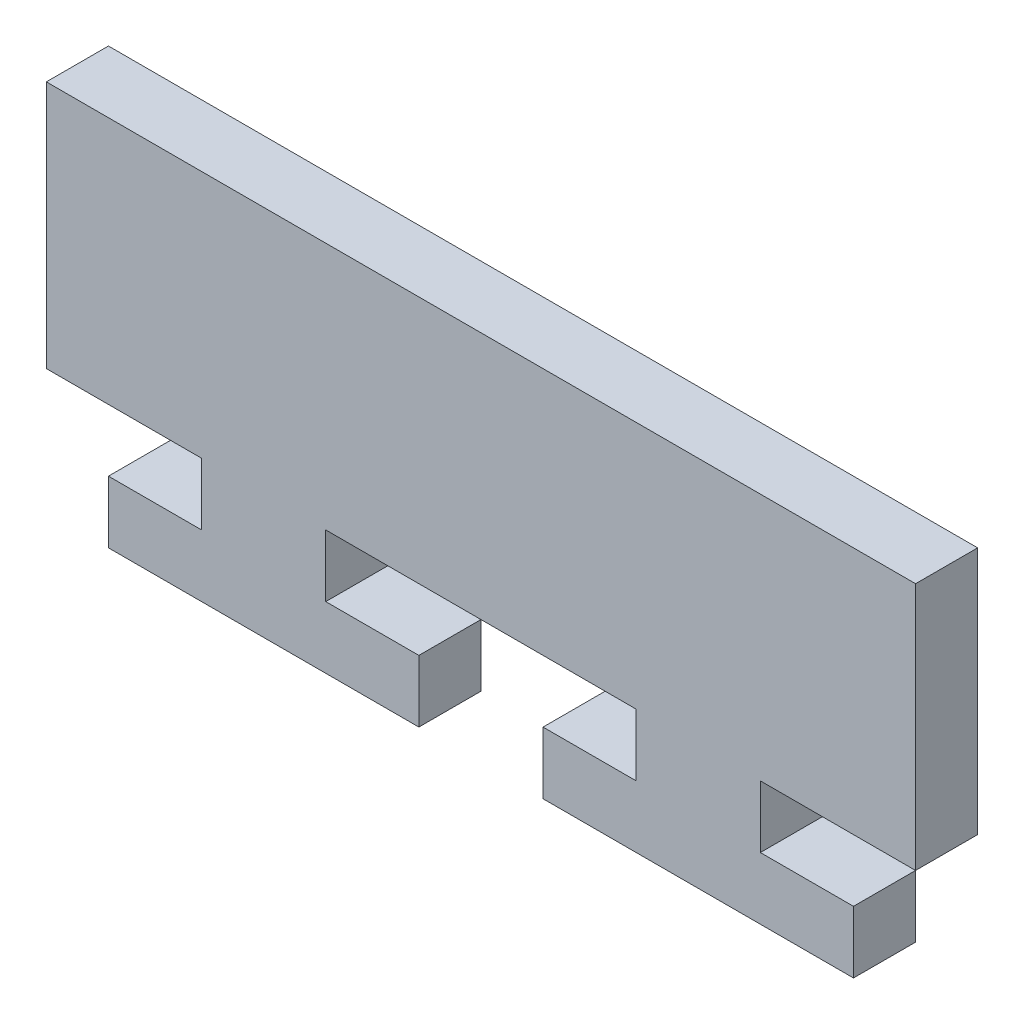
ISO-10303-21;
HEADER;
FILE_DESCRIPTION(('STEP AP214'),'2;1');
FILE_NAME('part.step','',(''),(''),'','','');
FILE_SCHEMA(('AUTOMOTIVE_DESIGN { 1 0 10303 214 1 1 1 1 }'));
ENDSEC;
DATA;
#1=APPLICATION_CONTEXT('core data for automotive mechanical design processes');
#2=APPLICATION_PROTOCOL_DEFINITION('international standard','automotive_design',2000,#1);
#3=PRODUCT_CONTEXT('',#1,'mechanical');
#4=PRODUCT('Part','Part','',(#3));
#5=PRODUCT_RELATED_PRODUCT_CATEGORY('part','',(#4));
#6=PRODUCT_DEFINITION_FORMATION('','',#4);
#7=PRODUCT_DEFINITION_CONTEXT('part definition',#1,'design');
#8=PRODUCT_DEFINITION('design','',#6,#7);
#9=PRODUCT_DEFINITION_SHAPE('','',#8);
#10=(LENGTH_UNIT() NAMED_UNIT(*) SI_UNIT(.MILLI.,.METRE.));
#11=(NAMED_UNIT(*) PLANE_ANGLE_UNIT() SI_UNIT($,.RADIAN.));
#12=(NAMED_UNIT(*) SI_UNIT($,.STERADIAN.) SOLID_ANGLE_UNIT());
#13=UNCERTAINTY_MEASURE_WITH_UNIT(LENGTH_MEASURE(1.E-05),#10,'distance_accuracy_value','');
#14=(GEOMETRIC_REPRESENTATION_CONTEXT(3) GLOBAL_UNCERTAINTY_ASSIGNED_CONTEXT((#13)) GLOBAL_UNIT_ASSIGNED_CONTEXT((#10,
#11,#12)) REPRESENTATION_CONTEXT('',''));
#15=CARTESIAN_POINT('',(0.,0.,0.));
#16=DIRECTION('',(0.,0.,1.));
#17=DIRECTION('',(1.,0.,0.));
#18=AXIS2_PLACEMENT_3D('',#15,#16,#17);
#19=CARTESIAN_POINT('',(-35.,10.,5.));
#20=DIRECTION('',(1.,0.,0.));
#21=DIRECTION('',(0.,1.,0.));
#22=AXIS2_PLACEMENT_3D('',#19,#20,#21);
#23=PLANE('',#22);
#24=DIRECTION('',(0.,-1.,0.));
#25=VECTOR('',#24,1.);
#26=CARTESIAN_POINT('',(-35.,10.,0.));
#27=LINE('',#26,#25);
#28=CARTESIAN_POINT('',(-35.,10.,0.));
#29=VERTEX_POINT('',#28);
#30=CARTESIAN_POINT('',(-35.,-10.,0.));
#31=VERTEX_POINT('',#30);
#32=EDGE_CURVE('E201',#29,#31,#27,.T.);
#33=ORIENTED_EDGE('',*,*,#32,.T.);
#34=DIRECTION('',(0.,0.,-1.));
#35=VECTOR('',#34,1.);
#36=CARTESIAN_POINT('',(-35.,-10.,5.));
#37=LINE('',#36,#35);
#38=CARTESIAN_POINT('',(-35.,-10.,5.));
#39=VERTEX_POINT('',#38);
#40=EDGE_CURVE('E11',#39,#31,#37,.T.);
#41=ORIENTED_EDGE('',*,*,#40,.F.);
#42=DIRECTION('',(0.,-1.,0.));
#43=VECTOR('',#42,1.);
#44=CARTESIAN_POINT('',(-35.,10.,5.));
#45=LINE('',#44,#43);
#46=CARTESIAN_POINT('',(-35.,10.,5.));
#47=VERTEX_POINT('',#46);
#48=EDGE_CURVE('E239',#47,#39,#45,.T.);
#49=ORIENTED_EDGE('',*,*,#48,.F.);
#50=DIRECTION('',(0.,0.,-1.));
#51=VECTOR('',#50,1.);
#52=CARTESIAN_POINT('',(-35.,10.,5.));
#53=LINE('',#52,#51);
#54=EDGE_CURVE('E197',#47,#29,#53,.T.);
#55=ORIENTED_EDGE('',*,*,#54,.T.);
#56=EDGE_LOOP('',(#33,#41,#49,#55));
#57=FACE_BOUND('',#56,.T.);
#58=ADVANCED_FACE('F33',(#57),#23,.F.);
#59=CARTESIAN_POINT('',(-35.,-10.,5.));
#60=DIRECTION('',(0.,1.,0.));
#61=DIRECTION('',(0.,0.,1.));
#62=AXIS2_PLACEMENT_3D('',#59,#60,#61);
#63=PLANE('',#62);
#64=DIRECTION('',(1.,0.,0.));
#65=VECTOR('',#64,1.);
#66=CARTESIAN_POINT('',(-35.,-10.,0.));
#67=LINE('',#66,#65);
#68=CARTESIAN_POINT('',(-22.5,-10.,0.));
#69=VERTEX_POINT('',#68);
#70=EDGE_CURVE('E204',#31,#69,#67,.T.);
#71=ORIENTED_EDGE('',*,*,#70,.T.);
#72=DIRECTION('',(0.,0.,-1.));
#73=VECTOR('',#72,1.);
#74=CARTESIAN_POINT('',(-22.5,-10.,5.));
#75=LINE('',#74,#73);
#76=CARTESIAN_POINT('',(-22.5,-10.,5.));
#77=VERTEX_POINT('',#76);
#78=EDGE_CURVE('E41',#77,#69,#75,.T.);
#79=ORIENTED_EDGE('',*,*,#78,.F.);
#80=DIRECTION('',(1.,0.,0.));
#81=VECTOR('',#80,1.);
#82=CARTESIAN_POINT('',(-35.,-10.,5.));
#83=LINE('',#82,#81);
#84=EDGE_CURVE('E128',#39,#77,#83,.T.);
#85=ORIENTED_EDGE('',*,*,#84,.F.);
#86=ORIENTED_EDGE('',*,*,#40,.T.);
#87=EDGE_LOOP('',(#71,#79,#85,#86));
#88=FACE_BOUND('',#87,.T.);
#89=ADVANCED_FACE('F357',(#88),#63,.F.);
#90=CARTESIAN_POINT('',(-22.5,-10.,5.));
#91=DIRECTION('',(1.,0.,0.));
#92=DIRECTION('',(0.,0.,-1.));
#93=AXIS2_PLACEMENT_3D('',#90,#91,#92);
#94=PLANE('',#93);
#95=DIRECTION('',(0.,-1.,0.));
#96=VECTOR('',#95,1.);
#97=CARTESIAN_POINT('',(-22.5,-10.,0.));
#98=LINE('',#97,#96);
#99=CARTESIAN_POINT('',(-22.5,-15.,0.));
#100=VERTEX_POINT('',#99);
#101=EDGE_CURVE('E206',#69,#100,#98,.T.);
#102=ORIENTED_EDGE('',*,*,#101,.T.);
#103=DIRECTION('',(0.,0.,-1.));
#104=VECTOR('',#103,1.);
#105=CARTESIAN_POINT('',(-22.5,-15.,5.));
#106=LINE('',#105,#104);
#107=CARTESIAN_POINT('',(-22.5,-15.,5.));
#108=VERTEX_POINT('',#107);
#109=EDGE_CURVE('E282',#108,#100,#106,.T.);
#110=ORIENTED_EDGE('',*,*,#109,.F.);
#111=DIRECTION('',(0.,-1.,0.));
#112=VECTOR('',#111,1.);
#113=CARTESIAN_POINT('',(-22.5,-10.,5.));
#114=LINE('',#113,#112);
#115=EDGE_CURVE('E290',#77,#108,#114,.T.);
#116=ORIENTED_EDGE('',*,*,#115,.F.);
#117=ORIENTED_EDGE('',*,*,#78,.T.);
#118=EDGE_LOOP('',(#102,#110,#116,#117));
#119=FACE_BOUND('',#118,.T.);
#120=ADVANCED_FACE('F288',(#119),#94,.F.);
#121=CARTESIAN_POINT('',(-22.5,-15.,5.));
#122=DIRECTION('',(0.,-1.,0.));
#123=DIRECTION('',(1.,0.,0.));
#124=AXIS2_PLACEMENT_3D('',#121,#122,#123);
#125=PLANE('',#124);
#126=DIRECTION('',(-1.,0.,0.));
#127=VECTOR('',#126,1.);
#128=CARTESIAN_POINT('',(-22.5,-15.,0.));
#129=LINE('',#128,#127);
#130=CARTESIAN_POINT('',(-30.,-15.,0.));
#131=VERTEX_POINT('',#130);
#132=EDGE_CURVE('E208',#100,#131,#129,.T.);
#133=ORIENTED_EDGE('',*,*,#132,.T.);
#134=DIRECTION('',(0.,0.,-1.));
#135=VECTOR('',#134,1.);
#136=CARTESIAN_POINT('',(-30.,-15.,5.));
#137=LINE('',#136,#135);
#138=CARTESIAN_POINT('',(-30.,-15.,5.));
#139=VERTEX_POINT('',#138);
#140=EDGE_CURVE('E279',#139,#131,#137,.T.);
#141=ORIENTED_EDGE('',*,*,#140,.F.);
#142=DIRECTION('',(-1.,0.,0.));
#143=VECTOR('',#142,1.);
#144=CARTESIAN_POINT('',(-22.5,-15.,5.));
#145=LINE('',#144,#143);
#146=EDGE_CURVE('E308',#108,#139,#145,.T.);
#147=ORIENTED_EDGE('',*,*,#146,.F.);
#148=ORIENTED_EDGE('',*,*,#109,.T.);
#149=EDGE_LOOP('',(#133,#141,#147,#148));
#150=FACE_BOUND('',#149,.T.);
#151=ADVANCED_FACE('F299',(#150),#125,.F.);
#152=CARTESIAN_POINT('',(-30.,-15.,5.));
#153=DIRECTION('',(1.,0.,0.));
#154=DIRECTION('',(0.,0.,-1.));
#155=AXIS2_PLACEMENT_3D('',#152,#153,#154);
#156=PLANE('',#155);
#157=DIRECTION('',(0.,-1.,0.));
#158=VECTOR('',#157,1.);
#159=CARTESIAN_POINT('',(-30.,-15.,0.));
#160=LINE('',#159,#158);
#161=CARTESIAN_POINT('',(-30.,-20.,0.));
#162=VERTEX_POINT('',#161);
#163=EDGE_CURVE('E210',#131,#162,#160,.T.);
#164=ORIENTED_EDGE('',*,*,#163,.T.);
#165=DIRECTION('',(0.,0.,-1.));
#166=VECTOR('',#165,1.);
#167=CARTESIAN_POINT('',(-30.,-20.,5.));
#168=LINE('',#167,#166);
#169=CARTESIAN_POINT('',(-30.,-20.,5.));
#170=VERTEX_POINT('',#169);
#171=EDGE_CURVE('E276',#170,#162,#168,.T.);
#172=ORIENTED_EDGE('',*,*,#171,.F.);
#173=DIRECTION('',(0.,-1.,0.));
#174=VECTOR('',#173,1.);
#175=CARTESIAN_POINT('',(-30.,-15.,5.));
#176=LINE('',#175,#174);
#177=EDGE_CURVE('E305',#139,#170,#176,.T.);
#178=ORIENTED_EDGE('',*,*,#177,.F.);
#179=ORIENTED_EDGE('',*,*,#140,.T.);
#180=EDGE_LOOP('',(#164,#172,#178,#179));
#181=FACE_BOUND('',#180,.T.);
#182=ADVANCED_FACE('F303',(#181),#156,.F.);
#183=CARTESIAN_POINT('',(-30.,-20.,5.));
#184=DIRECTION('',(0.,1.,0.));
#185=DIRECTION('',(-1.,0.,0.));
#186=AXIS2_PLACEMENT_3D('',#183,#184,#185);
#187=PLANE('',#186);
#188=DIRECTION('',(1.,0.,0.));
#189=VECTOR('',#188,1.);
#190=CARTESIAN_POINT('',(-30.,-20.,0.));
#191=LINE('',#190,#189);
#192=CARTESIAN_POINT('',(-4.99999999999999,-20.,0.));
#193=VERTEX_POINT('',#192);
#194=EDGE_CURVE('E212',#162,#193,#191,.T.);
#195=ORIENTED_EDGE('',*,*,#194,.T.);
#196=DIRECTION('',(0.,0.,-1.));
#197=VECTOR('',#196,1.);
#198=CARTESIAN_POINT('',(-4.99999999999999,-20.,5.));
#199=LINE('',#198,#197);
#200=CARTESIAN_POINT('',(-4.99999999999999,-20.,5.));
#201=VERTEX_POINT('',#200);
#202=EDGE_CURVE('E273',#201,#193,#199,.T.);
#203=ORIENTED_EDGE('',*,*,#202,.F.);
#204=DIRECTION('',(1.,0.,0.));
#205=VECTOR('',#204,1.);
#206=CARTESIAN_POINT('',(-30.,-20.,5.));
#207=LINE('',#206,#205);
#208=EDGE_CURVE('E307',#170,#201,#207,.T.);
#209=ORIENTED_EDGE('',*,*,#208,.F.);
#210=ORIENTED_EDGE('',*,*,#171,.T.);
#211=EDGE_LOOP('',(#195,#203,#209,#210));
#212=FACE_BOUND('',#211,.T.);
#213=ADVANCED_FACE('F370',(#212),#187,.F.);
#214=CARTESIAN_POINT('',(-4.99999999999999,-20.,5.));
#215=DIRECTION('',(-1.,0.,0.));
#216=DIRECTION('',(0.,0.,1.));
#217=AXIS2_PLACEMENT_3D('',#214,#215,#216);
#218=PLANE('',#217);
#219=DIRECTION('',(0.,1.,0.));
#220=VECTOR('',#219,1.);
#221=CARTESIAN_POINT('',(-4.99999999999999,-20.,0.));
#222=LINE('',#221,#220);
#223=CARTESIAN_POINT('',(-4.99999999999999,-15.,0.));
#224=VERTEX_POINT('',#223);
#225=EDGE_CURVE('E214',#193,#224,#222,.T.);
#226=ORIENTED_EDGE('',*,*,#225,.T.);
#227=DIRECTION('',(0.,0.,-1.));
#228=VECTOR('',#227,1.);
#229=CARTESIAN_POINT('',(-4.99999999999999,-15.,5.));
#230=LINE('',#229,#228);
#231=CARTESIAN_POINT('',(-4.99999999999999,-15.,5.));
#232=VERTEX_POINT('',#231);
#233=EDGE_CURVE('E270',#232,#224,#230,.T.);
#234=ORIENTED_EDGE('',*,*,#233,.F.);
#235=DIRECTION('',(0.,1.,0.));
#236=VECTOR('',#235,1.);
#237=CARTESIAN_POINT('',(-4.99999999999999,-20.,5.));
#238=LINE('',#237,#236);
#239=EDGE_CURVE('E310',#201,#232,#238,.T.);
#240=ORIENTED_EDGE('',*,*,#239,.F.);
#241=ORIENTED_EDGE('',*,*,#202,.T.);
#242=EDGE_LOOP('',(#226,#234,#240,#241));
#243=FACE_BOUND('',#242,.T.);
#244=ADVANCED_FACE('F373',(#243),#218,.F.);
#245=CARTESIAN_POINT('',(-4.99999999999999,-15.,5.));
#246=DIRECTION('',(0.,-1.,0.));
#247=DIRECTION('',(1.,0.,0.));
#248=AXIS2_PLACEMENT_3D('',#245,#246,#247);
#249=PLANE('',#248);
#250=DIRECTION('',(-1.,0.,0.));
#251=VECTOR('',#250,1.);
#252=CARTESIAN_POINT('',(-4.99999999999999,-15.,0.));
#253=LINE('',#252,#251);
#254=CARTESIAN_POINT('',(-12.5,-15.,0.));
#255=VERTEX_POINT('',#254);
#256=EDGE_CURVE('E216',#224,#255,#253,.T.);
#257=ORIENTED_EDGE('',*,*,#256,.T.);
#258=DIRECTION('',(0.,0.,-1.));
#259=VECTOR('',#258,1.);
#260=CARTESIAN_POINT('',(-12.5,-15.,5.));
#261=LINE('',#260,#259);
#262=CARTESIAN_POINT('',(-12.5,-15.,5.));
#263=VERTEX_POINT('',#262);
#264=EDGE_CURVE('E267',#263,#255,#261,.T.);
#265=ORIENTED_EDGE('',*,*,#264,.F.);
#266=DIRECTION('',(-1.,0.,0.));
#267=VECTOR('',#266,1.);
#268=CARTESIAN_POINT('',(-4.99999999999999,-15.,5.));
#269=LINE('',#268,#267);
#270=EDGE_CURVE('E316',#232,#263,#269,.T.);
#271=ORIENTED_EDGE('',*,*,#270,.F.);
#272=ORIENTED_EDGE('',*,*,#233,.T.);
#273=EDGE_LOOP('',(#257,#265,#271,#272));
#274=FACE_BOUND('',#273,.T.);
#275=ADVANCED_FACE('F377',(#274),#249,.F.);
#276=CARTESIAN_POINT('',(-12.5,-15.,5.));
#277=DIRECTION('',(-1.,0.,0.));
#278=DIRECTION('',(0.,0.,1.));
#279=AXIS2_PLACEMENT_3D('',#276,#277,#278);
#280=PLANE('',#279);
#281=DIRECTION('',(0.,1.,0.));
#282=VECTOR('',#281,1.);
#283=CARTESIAN_POINT('',(-12.5,-15.,0.));
#284=LINE('',#283,#282);
#285=CARTESIAN_POINT('',(-12.5,-10.,0.));
#286=VERTEX_POINT('',#285);
#287=EDGE_CURVE('E218',#255,#286,#284,.T.);
#288=ORIENTED_EDGE('',*,*,#287,.T.);
#289=DIRECTION('',(0.,0.,-1.));
#290=VECTOR('',#289,1.);
#291=CARTESIAN_POINT('',(-12.5,-10.,5.));
#292=LINE('',#291,#290);
#293=CARTESIAN_POINT('',(-12.5,-10.,5.));
#294=VERTEX_POINT('',#293);
#295=EDGE_CURVE('E264',#294,#286,#292,.T.);
#296=ORIENTED_EDGE('',*,*,#295,.F.);
#297=DIRECTION('',(0.,1.,0.));
#298=VECTOR('',#297,1.);
#299=CARTESIAN_POINT('',(-12.5,-15.,5.));
#300=LINE('',#299,#298);
#301=EDGE_CURVE('E318',#263,#294,#300,.T.);
#302=ORIENTED_EDGE('',*,*,#301,.F.);
#303=ORIENTED_EDGE('',*,*,#264,.T.);
#304=EDGE_LOOP('',(#288,#296,#302,#303));
#305=FACE_BOUND('',#304,.T.);
#306=ADVANCED_FACE('F381',(#305),#280,.F.);
#307=CARTESIAN_POINT('',(-12.5,-10.,5.));
#308=DIRECTION('',(0.,1.,0.));
#309=DIRECTION('',(0.,0.,1.));
#310=AXIS2_PLACEMENT_3D('',#307,#308,#309);
#311=PLANE('',#310);
#312=DIRECTION('',(1.,0.,0.));
#313=VECTOR('',#312,1.);
#314=CARTESIAN_POINT('',(-12.5,-10.,0.));
#315=LINE('',#314,#313);
#316=CARTESIAN_POINT('',(12.5,-10.,0.));
#317=VERTEX_POINT('',#316);
#318=EDGE_CURVE('E220',#286,#317,#315,.T.);
#319=ORIENTED_EDGE('',*,*,#318,.T.);
#320=DIRECTION('',(0.,0.,-1.));
#321=VECTOR('',#320,1.);
#322=CARTESIAN_POINT('',(12.5,-10.,5.));
#323=LINE('',#322,#321);
#324=CARTESIAN_POINT('',(12.5,-10.,5.));
#325=VERTEX_POINT('',#324);
#326=EDGE_CURVE('E261',#325,#317,#323,.T.);
#327=ORIENTED_EDGE('',*,*,#326,.F.);
#328=DIRECTION('',(1.,0.,0.));
#329=VECTOR('',#328,1.);
#330=CARTESIAN_POINT('',(-12.5,-10.,5.));
#331=LINE('',#330,#329);
#332=EDGE_CURVE('E320',#294,#325,#331,.T.);
#333=ORIENTED_EDGE('',*,*,#332,.F.);
#334=ORIENTED_EDGE('',*,*,#295,.T.);
#335=EDGE_LOOP('',(#319,#327,#333,#334));
#336=FACE_BOUND('',#335,.T.);
#337=ADVANCED_FACE('F385',(#336),#311,.F.);
#338=CARTESIAN_POINT('',(12.5,-10.,5.));
#339=DIRECTION('',(1.,0.,0.));
#340=DIRECTION('',(0.,0.,-1.));
#341=AXIS2_PLACEMENT_3D('',#338,#339,#340);
#342=PLANE('',#341);
#343=DIRECTION('',(0.,-1.,0.));
#344=VECTOR('',#343,1.);
#345=CARTESIAN_POINT('',(12.5,-10.,0.));
#346=LINE('',#345,#344);
#347=CARTESIAN_POINT('',(12.5,-15.,0.));
#348=VERTEX_POINT('',#347);
#349=EDGE_CURVE('E222',#317,#348,#346,.T.);
#350=ORIENTED_EDGE('',*,*,#349,.T.);
#351=DIRECTION('',(0.,0.,-1.));
#352=VECTOR('',#351,1.);
#353=CARTESIAN_POINT('',(12.5,-15.,5.));
#354=LINE('',#353,#352);
#355=CARTESIAN_POINT('',(12.5,-15.,5.));
#356=VERTEX_POINT('',#355);
#357=EDGE_CURVE('E258',#356,#348,#354,.T.);
#358=ORIENTED_EDGE('',*,*,#357,.F.);
#359=DIRECTION('',(0.,-1.,0.));
#360=VECTOR('',#359,1.);
#361=CARTESIAN_POINT('',(12.5,-10.,5.));
#362=LINE('',#361,#360);
#363=EDGE_CURVE('E322',#325,#356,#362,.T.);
#364=ORIENTED_EDGE('',*,*,#363,.F.);
#365=ORIENTED_EDGE('',*,*,#326,.T.);
#366=EDGE_LOOP('',(#350,#358,#364,#365));
#367=FACE_BOUND('',#366,.T.);
#368=ADVANCED_FACE('F389',(#367),#342,.F.);
#369=CARTESIAN_POINT('',(12.5,-15.,5.));
#370=DIRECTION('',(0.,-1.,0.));
#371=DIRECTION('',(1.,0.,0.));
#372=AXIS2_PLACEMENT_3D('',#369,#370,#371);
#373=PLANE('',#372);
#374=DIRECTION('',(-1.,0.,0.));
#375=VECTOR('',#374,1.);
#376=CARTESIAN_POINT('',(12.5,-15.,0.));
#377=LINE('',#376,#375);
#378=CARTESIAN_POINT('',(5.00000000000001,-15.,0.));
#379=VERTEX_POINT('',#378);
#380=EDGE_CURVE('E224',#348,#379,#377,.T.);
#381=ORIENTED_EDGE('',*,*,#380,.T.);
#382=DIRECTION('',(0.,0.,-1.));
#383=VECTOR('',#382,1.);
#384=CARTESIAN_POINT('',(5.00000000000001,-15.,5.));
#385=LINE('',#384,#383);
#386=CARTESIAN_POINT('',(5.00000000000001,-15.,5.));
#387=VERTEX_POINT('',#386);
#388=EDGE_CURVE('E255',#387,#379,#385,.T.);
#389=ORIENTED_EDGE('',*,*,#388,.F.);
#390=DIRECTION('',(-1.,0.,0.));
#391=VECTOR('',#390,1.);
#392=CARTESIAN_POINT('',(12.5,-15.,5.));
#393=LINE('',#392,#391);
#394=EDGE_CURVE('E324',#356,#387,#393,.T.);
#395=ORIENTED_EDGE('',*,*,#394,.F.);
#396=ORIENTED_EDGE('',*,*,#357,.T.);
#397=EDGE_LOOP('',(#381,#389,#395,#396));
#398=FACE_BOUND('',#397,.T.);
#399=ADVANCED_FACE('F393',(#398),#373,.F.);
#400=CARTESIAN_POINT('',(5.00000000000001,-15.,5.));
#401=DIRECTION('',(1.,0.,0.));
#402=DIRECTION('',(0.,1.,0.));
#403=AXIS2_PLACEMENT_3D('',#400,#401,#402);
#404=PLANE('',#403);
#405=DIRECTION('',(0.,-1.,0.));
#406=VECTOR('',#405,1.);
#407=CARTESIAN_POINT('',(5.00000000000001,-15.,0.));
#408=LINE('',#407,#406);
#409=CARTESIAN_POINT('',(5.00000000000001,-20.,0.));
#410=VERTEX_POINT('',#409);
#411=EDGE_CURVE('E226',#379,#410,#408,.T.);
#412=ORIENTED_EDGE('',*,*,#411,.T.);
#413=DIRECTION('',(0.,0.,-1.));
#414=VECTOR('',#413,1.);
#415=CARTESIAN_POINT('',(5.00000000000001,-20.,5.));
#416=LINE('',#415,#414);
#417=CARTESIAN_POINT('',(5.00000000000001,-20.,5.));
#418=VERTEX_POINT('',#417);
#419=EDGE_CURVE('E252',#418,#410,#416,.T.);
#420=ORIENTED_EDGE('',*,*,#419,.F.);
#421=DIRECTION('',(0.,-1.,0.));
#422=VECTOR('',#421,1.);
#423=CARTESIAN_POINT('',(5.00000000000001,-15.,5.));
#424=LINE('',#423,#422);
#425=EDGE_CURVE('E326',#387,#418,#424,.T.);
#426=ORIENTED_EDGE('',*,*,#425,.F.);
#427=ORIENTED_EDGE('',*,*,#388,.T.);
#428=EDGE_LOOP('',(#412,#420,#426,#427));
#429=FACE_BOUND('',#428,.T.);
#430=ADVANCED_FACE('F397',(#429),#404,.F.);
#431=CARTESIAN_POINT('',(5.00000000000001,-20.,5.));
#432=DIRECTION('',(0.,1.,0.));
#433=DIRECTION('',(-1.,0.,0.));
#434=AXIS2_PLACEMENT_3D('',#431,#432,#433);
#435=PLANE('',#434);
#436=DIRECTION('',(1.,0.,0.));
#437=VECTOR('',#436,1.);
#438=CARTESIAN_POINT('',(5.00000000000001,-20.,0.));
#439=LINE('',#438,#437);
#440=CARTESIAN_POINT('',(30.,-20.,0.));
#441=VERTEX_POINT('',#440);
#442=EDGE_CURVE('E228',#410,#441,#439,.T.);
#443=ORIENTED_EDGE('',*,*,#442,.T.);
#444=DIRECTION('',(0.,0.,-1.));
#445=VECTOR('',#444,1.);
#446=CARTESIAN_POINT('',(30.,-20.,5.));
#447=LINE('',#446,#445);
#448=CARTESIAN_POINT('',(30.,-20.,5.));
#449=VERTEX_POINT('',#448);
#450=EDGE_CURVE('E249',#449,#441,#447,.T.);
#451=ORIENTED_EDGE('',*,*,#450,.F.);
#452=DIRECTION('',(1.,0.,0.));
#453=VECTOR('',#452,1.);
#454=CARTESIAN_POINT('',(5.00000000000001,-20.,5.));
#455=LINE('',#454,#453);
#456=EDGE_CURVE('E328',#418,#449,#455,.T.);
#457=ORIENTED_EDGE('',*,*,#456,.F.);
#458=ORIENTED_EDGE('',*,*,#419,.T.);
#459=EDGE_LOOP('',(#443,#451,#457,#458));
#460=FACE_BOUND('',#459,.T.);
#461=ADVANCED_FACE('F401',(#460),#435,.F.);
#462=CARTESIAN_POINT('',(30.,-20.,5.));
#463=DIRECTION('',(-1.,0.,0.));
#464=DIRECTION('',(0.,0.,1.));
#465=AXIS2_PLACEMENT_3D('',#462,#463,#464);
#466=PLANE('',#465);
#467=DIRECTION('',(0.,1.,0.));
#468=VECTOR('',#467,1.);
#469=CARTESIAN_POINT('',(30.,-20.,0.));
#470=LINE('',#469,#468);
#471=CARTESIAN_POINT('',(30.,-15.,0.));
#472=VERTEX_POINT('',#471);
#473=EDGE_CURVE('E230',#441,#472,#470,.T.);
#474=ORIENTED_EDGE('',*,*,#473,.T.);
#475=DIRECTION('',(0.,0.,-1.));
#476=VECTOR('',#475,1.);
#477=CARTESIAN_POINT('',(30.,-15.,5.));
#478=LINE('',#477,#476);
#479=CARTESIAN_POINT('',(30.,-15.,5.));
#480=VERTEX_POINT('',#479);
#481=EDGE_CURVE('E246',#480,#472,#478,.T.);
#482=ORIENTED_EDGE('',*,*,#481,.F.);
#483=DIRECTION('',(0.,1.,0.));
#484=VECTOR('',#483,1.);
#485=CARTESIAN_POINT('',(30.,-20.,5.));
#486=LINE('',#485,#484);
#487=EDGE_CURVE('E330',#449,#480,#486,.T.);
#488=ORIENTED_EDGE('',*,*,#487,.F.);
#489=ORIENTED_EDGE('',*,*,#450,.T.);
#490=EDGE_LOOP('',(#474,#482,#488,#489));
#491=FACE_BOUND('',#490,.T.);
#492=ADVANCED_FACE('F405',(#491),#466,.F.);
#493=CARTESIAN_POINT('',(30.,-15.,5.));
#494=DIRECTION('',(0.,-1.,0.));
#495=DIRECTION('',(1.,0.,0.));
#496=AXIS2_PLACEMENT_3D('',#493,#494,#495);
#497=PLANE('',#496);
#498=DIRECTION('',(-1.,0.,0.));
#499=VECTOR('',#498,1.);
#500=CARTESIAN_POINT('',(30.,-15.,0.));
#501=LINE('',#500,#499);
#502=CARTESIAN_POINT('',(22.5,-15.,0.));
#503=VERTEX_POINT('',#502);
#504=EDGE_CURVE('E232',#472,#503,#501,.T.);
#505=ORIENTED_EDGE('',*,*,#504,.T.);
#506=DIRECTION('',(0.,0.,-1.));
#507=VECTOR('',#506,1.);
#508=CARTESIAN_POINT('',(22.5,-15.,5.));
#509=LINE('',#508,#507);
#510=CARTESIAN_POINT('',(22.5,-15.,5.));
#511=VERTEX_POINT('',#510);
#512=EDGE_CURVE('E243',#511,#503,#509,.T.);
#513=ORIENTED_EDGE('',*,*,#512,.F.);
#514=DIRECTION('',(-1.,0.,0.));
#515=VECTOR('',#514,1.);
#516=CARTESIAN_POINT('',(30.,-15.,5.));
#517=LINE('',#516,#515);
#518=EDGE_CURVE('E332',#480,#511,#517,.T.);
#519=ORIENTED_EDGE('',*,*,#518,.F.);
#520=ORIENTED_EDGE('',*,*,#481,.T.);
#521=EDGE_LOOP('',(#505,#513,#519,#520));
#522=FACE_BOUND('',#521,.T.);
#523=ADVANCED_FACE('F338',(#522),#497,.F.);
#524=CARTESIAN_POINT('',(22.5,-15.,5.));
#525=DIRECTION('',(-1.,0.,0.));
#526=DIRECTION('',(0.,-1.,0.));
#527=AXIS2_PLACEMENT_3D('',#524,#525,#526);
#528=PLANE('',#527);
#529=DIRECTION('',(0.,1.,0.));
#530=VECTOR('',#529,1.);
#531=CARTESIAN_POINT('',(22.5,-15.,0.));
#532=LINE('',#531,#530);
#533=CARTESIAN_POINT('',(22.5,-10.,0.));
#534=VERTEX_POINT('',#533);
#535=EDGE_CURVE('E234',#503,#534,#532,.T.);
#536=ORIENTED_EDGE('',*,*,#535,.T.);
#537=DIRECTION('',(0.,0.,-1.));
#538=VECTOR('',#537,1.);
#539=CARTESIAN_POINT('',(22.5,-10.,5.));
#540=LINE('',#539,#538);
#541=CARTESIAN_POINT('',(22.5,-10.,5.));
#542=VERTEX_POINT('',#541);
#543=EDGE_CURVE('E192',#542,#534,#540,.T.);
#544=ORIENTED_EDGE('',*,*,#543,.F.);
#545=DIRECTION('',(0.,1.,0.));
#546=VECTOR('',#545,1.);
#547=CARTESIAN_POINT('',(22.5,-15.,5.));
#548=LINE('',#547,#546);
#549=EDGE_CURVE('E183',#511,#542,#548,.T.);
#550=ORIENTED_EDGE('',*,*,#549,.F.);
#551=ORIENTED_EDGE('',*,*,#512,.T.);
#552=EDGE_LOOP('',(#536,#544,#550,#551));
#553=FACE_BOUND('',#552,.T.);
#554=ADVANCED_FACE('F342',(#553),#528,.F.);
#555=CARTESIAN_POINT('',(22.5,-10.,5.));
#556=DIRECTION('',(0.,1.,0.));
#557=DIRECTION('',(0.,0.,1.));
#558=AXIS2_PLACEMENT_3D('',#555,#556,#557);
#559=PLANE('',#558);
#560=DIRECTION('',(1.,0.,0.));
#561=VECTOR('',#560,1.);
#562=CARTESIAN_POINT('',(22.5,-10.,0.));
#563=LINE('',#562,#561);
#564=CARTESIAN_POINT('',(35.,-10.,0.));
#565=VERTEX_POINT('',#564);
#566=EDGE_CURVE('E191',#534,#565,#563,.T.);
#567=ORIENTED_EDGE('',*,*,#566,.T.);
#568=DIRECTION('',(0.,0.,-1.));
#569=VECTOR('',#568,1.);
#570=CARTESIAN_POINT('',(35.,-10.,5.));
#571=LINE('',#570,#569);
#572=CARTESIAN_POINT('',(35.,-10.,5.));
#573=VERTEX_POINT('',#572);
#574=EDGE_CURVE('E188',#573,#565,#571,.T.);
#575=ORIENTED_EDGE('',*,*,#574,.F.);
#576=DIRECTION('',(1.,0.,0.));
#577=VECTOR('',#576,1.);
#578=CARTESIAN_POINT('',(22.5,-10.,5.));
#579=LINE('',#578,#577);
#580=EDGE_CURVE('E177',#542,#573,#579,.T.);
#581=ORIENTED_EDGE('',*,*,#580,.F.);
#582=ORIENTED_EDGE('',*,*,#543,.T.);
#583=EDGE_LOOP('',(#567,#575,#581,#582));
#584=FACE_BOUND('',#583,.T.);
#585=ADVANCED_FACE('F189',(#584),#559,.F.);
#586=CARTESIAN_POINT('',(35.,10.,5.));
#587=DIRECTION('',(-1.,0.,0.));
#588=DIRECTION('',(0.,-1.,0.));
#589=AXIS2_PLACEMENT_3D('',#586,#587,#588);
#590=PLANE('',#589);
#591=DIRECTION('',(0.,1.,0.));
#592=VECTOR('',#591,1.);
#593=CARTESIAN_POINT('',(35.,10.,0.));
#594=LINE('',#593,#592);
#595=CARTESIAN_POINT('',(35.,10.,0.));
#596=VERTEX_POINT('',#595);
#597=EDGE_CURVE('E114',#565,#596,#594,.T.);
#598=ORIENTED_EDGE('',*,*,#597,.T.);
#599=DIRECTION('',(0.,0.,-1.));
#600=VECTOR('',#599,1.);
#601=CARTESIAN_POINT('',(35.,10.,5.));
#602=LINE('',#601,#600);
#603=CARTESIAN_POINT('',(35.,10.,5.));
#604=VERTEX_POINT('',#603);
#605=EDGE_CURVE('E193',#604,#596,#602,.T.);
#606=ORIENTED_EDGE('',*,*,#605,.F.);
#607=DIRECTION('',(0.,1.,0.));
#608=VECTOR('',#607,1.);
#609=CARTESIAN_POINT('',(35.,10.,5.));
#610=LINE('',#609,#608);
#611=EDGE_CURVE('E181',#573,#604,#610,.T.);
#612=ORIENTED_EDGE('',*,*,#611,.F.);
#613=ORIENTED_EDGE('',*,*,#574,.T.);
#614=EDGE_LOOP('',(#598,#606,#612,#613));
#615=FACE_BOUND('',#614,.T.);
#616=ADVANCED_FACE('F195',(#615),#590,.F.);
#617=CARTESIAN_POINT('',(-35.,10.,5.));
#618=DIRECTION('',(0.,-1.,0.));
#619=DIRECTION('',(0.,0.,-1.));
#620=AXIS2_PLACEMENT_3D('',#617,#618,#619);
#621=PLANE('',#620);
#622=DIRECTION('',(-1.,0.,0.));
#623=VECTOR('',#622,1.);
#624=CARTESIAN_POINT('',(-35.,10.,0.));
#625=LINE('',#624,#623);
#626=EDGE_CURVE('E120',#596,#29,#625,.T.);
#627=ORIENTED_EDGE('',*,*,#626,.T.);
#628=ORIENTED_EDGE('',*,*,#54,.F.);
#629=DIRECTION('',(-1.,0.,0.));
#630=VECTOR('',#629,1.);
#631=CARTESIAN_POINT('',(-35.,10.,5.));
#632=LINE('',#631,#630);
#633=EDGE_CURVE('E49',#604,#47,#632,.T.);
#634=ORIENTED_EDGE('',*,*,#633,.F.);
#635=ORIENTED_EDGE('',*,*,#605,.T.);
#636=EDGE_LOOP('',(#627,#628,#634,#635));
#637=FACE_BOUND('',#636,.T.);
#638=ADVANCED_FACE('F346',(#637),#621,.F.);
#639=CARTESIAN_POINT('',(-35.,-10.,5.));
#640=DIRECTION('',(0.,0.,1.));
#641=DIRECTION('',(1.,0.,0.));
#642=AXIS2_PLACEMENT_3D('',#639,#640,#641);
#643=PLANE('',#642);
#644=ORIENTED_EDGE('',*,*,#48,.T.);
#645=ORIENTED_EDGE('',*,*,#84,.T.);
#646=ORIENTED_EDGE('',*,*,#115,.T.);
#647=ORIENTED_EDGE('',*,*,#146,.T.);
#648=ORIENTED_EDGE('',*,*,#177,.T.);
#649=ORIENTED_EDGE('',*,*,#208,.T.);
#650=ORIENTED_EDGE('',*,*,#239,.T.);
#651=ORIENTED_EDGE('',*,*,#270,.T.);
#652=ORIENTED_EDGE('',*,*,#301,.T.);
#653=ORIENTED_EDGE('',*,*,#332,.T.);
#654=ORIENTED_EDGE('',*,*,#363,.T.);
#655=ORIENTED_EDGE('',*,*,#394,.T.);
#656=ORIENTED_EDGE('',*,*,#425,.T.);
#657=ORIENTED_EDGE('',*,*,#456,.T.);
#658=ORIENTED_EDGE('',*,*,#487,.T.);
#659=ORIENTED_EDGE('',*,*,#518,.T.);
#660=ORIENTED_EDGE('',*,*,#549,.T.);
#661=ORIENTED_EDGE('',*,*,#580,.T.);
#662=ORIENTED_EDGE('',*,*,#611,.T.);
#663=ORIENTED_EDGE('',*,*,#633,.T.);
#664=EDGE_LOOP('',(#644,#645,#646,#647,#648,#649,#650,#651,#652,#653,#654,#655,#656,#657,#658,
#659,#660,#661,#662,#663));
#665=FACE_BOUND('',#664,.T.);
#666=ADVANCED_FACE('F179',(#665),#643,.T.);
#667=CARTESIAN_POINT('',(-35.,-10.,0.));
#668=DIRECTION('',(0.,0.,1.));
#669=DIRECTION('',(1.,0.,0.));
#670=AXIS2_PLACEMENT_3D('',#667,#668,#669);
#671=PLANE('',#670);
#672=ORIENTED_EDGE('',*,*,#32,.F.);
#673=ORIENTED_EDGE('',*,*,#626,.F.);
#674=ORIENTED_EDGE('',*,*,#597,.F.);
#675=ORIENTED_EDGE('',*,*,#566,.F.);
#676=ORIENTED_EDGE('',*,*,#535,.F.);
#677=ORIENTED_EDGE('',*,*,#504,.F.);
#678=ORIENTED_EDGE('',*,*,#473,.F.);
#679=ORIENTED_EDGE('',*,*,#442,.F.);
#680=ORIENTED_EDGE('',*,*,#411,.F.);
#681=ORIENTED_EDGE('',*,*,#380,.F.);
#682=ORIENTED_EDGE('',*,*,#349,.F.);
#683=ORIENTED_EDGE('',*,*,#318,.F.);
#684=ORIENTED_EDGE('',*,*,#287,.F.);
#685=ORIENTED_EDGE('',*,*,#256,.F.);
#686=ORIENTED_EDGE('',*,*,#225,.F.);
#687=ORIENTED_EDGE('',*,*,#194,.F.);
#688=ORIENTED_EDGE('',*,*,#163,.F.);
#689=ORIENTED_EDGE('',*,*,#132,.F.);
#690=ORIENTED_EDGE('',*,*,#101,.F.);
#691=ORIENTED_EDGE('',*,*,#70,.F.);
#692=EDGE_LOOP('',(#672,#673,#674,#675,#676,#677,#678,#679,#680,#681,#682,#683,#684,#685,#686,
#687,#688,#689,#690,#691));
#693=FACE_BOUND('',#692,.T.);
#694=ADVANCED_FACE('F294',(#693),#671,.F.);
#695=CLOSED_SHELL('',(#58,#89,#120,#151,#182,#213,#244,#275,#306,#337,#368,#399,#430,#461,#492,
#523,#554,#585,#616,#638,#666,#694));
#696=MANIFOLD_SOLID_BREP('B2',#695);
#697=ADVANCED_BREP_SHAPE_REPRESENTATION('',(#18,#696),#14);
#698=SHAPE_DEFINITION_REPRESENTATION(#9,#697);
ENDSEC;
END-ISO-10303-21;
